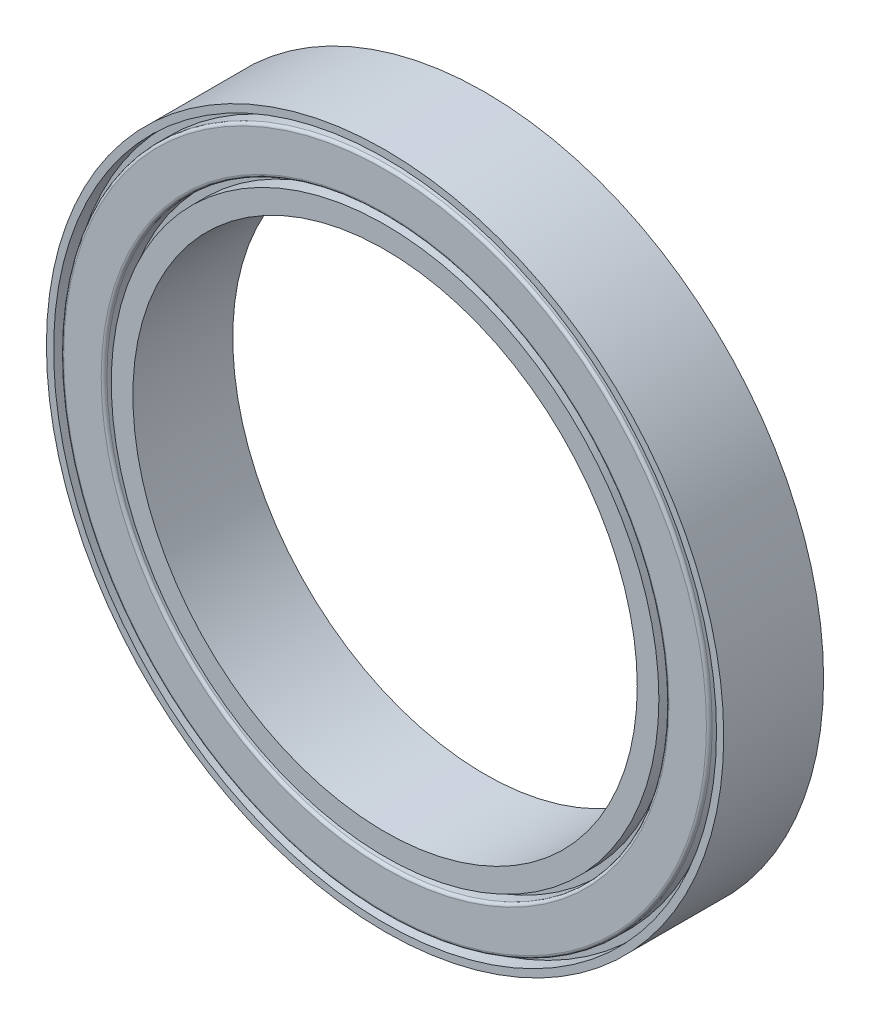
ISO-10303-21;
HEADER;
FILE_DESCRIPTION(('STEP AP214'),'2;1');
FILE_NAME('part.step','',(''),(''),'','','');
FILE_SCHEMA(('AUTOMOTIVE_DESIGN { 1 0 10303 214 1 1 1 1 }'));
ENDSEC;
DATA;
#1=APPLICATION_CONTEXT('core data for automotive mechanical design processes');
#2=APPLICATION_PROTOCOL_DEFINITION('international standard','automotive_design',2000,#1);
#3=PRODUCT_CONTEXT('',#1,'mechanical');
#4=PRODUCT('Part','Part','',(#3));
#5=PRODUCT_RELATED_PRODUCT_CATEGORY('part','',(#4));
#6=PRODUCT_DEFINITION_FORMATION('','',#4);
#7=PRODUCT_DEFINITION_CONTEXT('part definition',#1,'design');
#8=PRODUCT_DEFINITION('design','',#6,#7);
#9=PRODUCT_DEFINITION_SHAPE('','',#8);
#10=(LENGTH_UNIT() NAMED_UNIT(*) SI_UNIT(.MILLI.,.METRE.));
#11=(NAMED_UNIT(*) PLANE_ANGLE_UNIT() SI_UNIT($,.RADIAN.));
#12=(NAMED_UNIT(*) SI_UNIT($,.STERADIAN.) SOLID_ANGLE_UNIT());
#13=UNCERTAINTY_MEASURE_WITH_UNIT(LENGTH_MEASURE(1.E-05),#10,'distance_accuracy_value','');
#14=(GEOMETRIC_REPRESENTATION_CONTEXT(3) GLOBAL_UNCERTAINTY_ASSIGNED_CONTEXT((#13)) GLOBAL_UNIT_ASSIGNED_CONTEXT((#10,
#11,#12)) REPRESENTATION_CONTEXT('',''));
#15=CARTESIAN_POINT('',(0.,0.,0.));
#16=DIRECTION('',(0.,0.,1.));
#17=DIRECTION('',(1.,0.,0.));
#18=AXIS2_PLACEMENT_3D('',#15,#16,#17);
#19=CARTESIAN_POINT('',(0.,0.,0.));
#20=DIRECTION('',(0.,0.,1.));
#21=DIRECTION('',(1.,0.,0.));
#22=AXIS2_PLACEMENT_3D('',#19,#20,#21);
#23=PLANE('',#22);
#24=CARTESIAN_POINT('',(0.,0.,0.));
#25=DIRECTION('',(0.,0.,1.));
#26=DIRECTION('',(1.,0.,0.));
#27=AXIS2_PLACEMENT_3D('',#24,#25,#26);
#28=CIRCLE('',#27,17.5);
#29=CARTESIAN_POINT('',(17.5,0.,0.));
#30=VERTEX_POINT('',#29);
#31=EDGE_CURVE('E85',#30,#30,#28,.T.);
#32=ORIENTED_EDGE('',*,*,#31,.T.);
#33=EDGE_LOOP('',(#32));
#34=FACE_BOUND('',#33,.T.);
#35=CARTESIAN_POINT('',(0.,0.,0.));
#36=DIRECTION('',(0.,0.,1.));
#37=DIRECTION('',(1.,0.,0.));
#38=AXIS2_PLACEMENT_3D('',#35,#36,#37);
#39=CIRCLE('',#38,19.);
#40=CARTESIAN_POINT('',(19.,0.,0.));
#41=VERTEX_POINT('',#40);
#42=EDGE_CURVE('E121',#41,#41,#39,.T.);
#43=ORIENTED_EDGE('',*,*,#42,.F.);
#44=EDGE_LOOP('',(#43));
#45=FACE_BOUND('',#44,.T.);
#46=ADVANCED_FACE('F46',(#34,#45),#23,.F.);
#47=CARTESIAN_POINT('',(0.,0.,0.));
#48=DIRECTION('',(0.,0.,1.));
#49=DIRECTION('',(1.,0.,0.));
#50=AXIS2_PLACEMENT_3D('',#47,#48,#49);
#51=CIRCLE('',#50,19.7);
#52=CARTESIAN_POINT('',(19.7,0.,0.));
#53=VERTEX_POINT('',#52);
#54=EDGE_CURVE('E72',#53,#53,#51,.T.);
#55=ORIENTED_EDGE('',*,*,#54,.T.);
#56=EDGE_LOOP('',(#55));
#57=FACE_BOUND('',#56,.T.);
#58=CARTESIAN_POINT('',(0.,0.,0.));
#59=DIRECTION('',(0.,0.,1.));
#60=DIRECTION('',(1.,0.,0.));
#61=AXIS2_PLACEMENT_3D('',#58,#59,#60);
#62=CIRCLE('',#61,22.3);
#63=CARTESIAN_POINT('',(22.3,0.,0.));
#64=VERTEX_POINT('',#63);
#65=EDGE_CURVE('E75',#64,#64,#62,.F.);
#66=ORIENTED_EDGE('',*,*,#65,.T.);
#67=EDGE_LOOP('',(#66));
#68=FACE_BOUND('',#67,.T.);
#69=ADVANCED_FACE('F138',(#57,#68),#23,.F.);
#70=CARTESIAN_POINT('',(0.,0.,6.93));
#71=DIRECTION('',(0.,0.,1.));
#72=DIRECTION('',(1.,0.,0.));
#73=AXIS2_PLACEMENT_3D('',#70,#71,#72);
#74=PLANE('',#73);
#75=CARTESIAN_POINT('',(0.,0.,6.93));
#76=DIRECTION('',(0.,0.,1.));
#77=DIRECTION('',(1.,0.,0.));
#78=AXIS2_PLACEMENT_3D('',#75,#76,#77);
#79=CIRCLE('',#78,17.5);
#80=CARTESIAN_POINT('',(17.5,0.,6.93));
#81=VERTEX_POINT('',#80);
#82=EDGE_CURVE('E82',#81,#81,#79,.T.);
#83=ORIENTED_EDGE('',*,*,#82,.F.);
#84=EDGE_LOOP('',(#83));
#85=FACE_BOUND('',#84,.T.);
#86=CARTESIAN_POINT('',(0.,0.,6.93));
#87=DIRECTION('',(0.,0.,1.));
#88=DIRECTION('',(1.,0.,0.));
#89=AXIS2_PLACEMENT_3D('',#86,#87,#88);
#90=CIRCLE('',#89,19.);
#91=CARTESIAN_POINT('',(19.,0.,6.93));
#92=VERTEX_POINT('',#91);
#93=EDGE_CURVE('E103',#92,#92,#90,.T.);
#94=ORIENTED_EDGE('',*,*,#93,.T.);
#95=EDGE_LOOP('',(#94));
#96=FACE_BOUND('',#95,.T.);
#97=ADVANCED_FACE('F145',(#85,#96),#74,.T.);
#98=CARTESIAN_POINT('',(0.,0.,6.93));
#99=DIRECTION('',(0.,0.,1.));
#100=DIRECTION('',(1.,0.,0.));
#101=AXIS2_PLACEMENT_3D('',#98,#99,#100);
#102=CIRCLE('',#101,19.7);
#103=CARTESIAN_POINT('',(19.7,0.,6.93));
#104=VERTEX_POINT('',#103);
#105=EDGE_CURVE('E53',#104,#104,#102,.F.);
#106=ORIENTED_EDGE('',*,*,#105,.T.);
#107=EDGE_LOOP('',(#106));
#108=FACE_BOUND('',#107,.T.);
#109=CARTESIAN_POINT('',(0.,0.,6.93));
#110=DIRECTION('',(0.,0.,1.));
#111=DIRECTION('',(1.,0.,0.));
#112=AXIS2_PLACEMENT_3D('',#109,#110,#111);
#113=CIRCLE('',#112,22.3);
#114=CARTESIAN_POINT('',(22.3,0.,6.93));
#115=VERTEX_POINT('',#114);
#116=EDGE_CURVE('E57',#115,#115,#113,.T.);
#117=ORIENTED_EDGE('',*,*,#116,.T.);
#118=EDGE_LOOP('',(#117));
#119=FACE_BOUND('',#118,.T.);
#120=ADVANCED_FACE('F159',(#108,#119),#74,.T.);
#121=CARTESIAN_POINT('',(0.,0.,6.93));
#122=DIRECTION('',(0.,0.,1.));
#123=DIRECTION('',(1.,0.,0.));
#124=AXIS2_PLACEMENT_3D('',#121,#122,#123);
#125=CIRCLE('',#124,23.);
#126=CARTESIAN_POINT('',(23.,0.,6.93));
#127=VERTEX_POINT('',#126);
#128=EDGE_CURVE('E91',#127,#127,#125,.T.);
#129=ORIENTED_EDGE('',*,*,#128,.F.);
#130=EDGE_LOOP('',(#129));
#131=FACE_BOUND('',#130,.T.);
#132=CARTESIAN_POINT('',(0.,0.,6.93));
#133=DIRECTION('',(0.,0.,1.));
#134=DIRECTION('',(1.,0.,0.));
#135=AXIS2_PLACEMENT_3D('',#132,#133,#134);
#136=CIRCLE('',#135,23.5);
#137=CARTESIAN_POINT('',(23.5,0.,6.93));
#138=VERTEX_POINT('',#137);
#139=EDGE_CURVE('E78',#138,#138,#136,.T.);
#140=ORIENTED_EDGE('',*,*,#139,.T.);
#141=EDGE_LOOP('',(#140));
#142=FACE_BOUND('',#141,.T.);
#143=ADVANCED_FACE('F151',(#131,#142),#74,.T.);
#144=CARTESIAN_POINT('',(0.,0.,0.));
#145=DIRECTION('',(0.,0.,1.));
#146=DIRECTION('',(1.,0.,0.));
#147=AXIS2_PLACEMENT_3D('',#144,#145,#146);
#148=CIRCLE('',#147,23.);
#149=CARTESIAN_POINT('',(23.,0.,0.));
#150=VERTEX_POINT('',#149);
#151=EDGE_CURVE('E109',#150,#150,#148,.T.);
#152=ORIENTED_EDGE('',*,*,#151,.T.);
#153=EDGE_LOOP('',(#152));
#154=FACE_BOUND('',#153,.T.);
#155=CARTESIAN_POINT('',(0.,0.,0.));
#156=DIRECTION('',(0.,0.,1.));
#157=DIRECTION('',(1.,0.,0.));
#158=AXIS2_PLACEMENT_3D('',#155,#156,#157);
#159=CIRCLE('',#158,23.5);
#160=CARTESIAN_POINT('',(23.5,0.,0.));
#161=VERTEX_POINT('',#160);
#162=EDGE_CURVE('E79',#161,#161,#159,.T.);
#163=ORIENTED_EDGE('',*,*,#162,.F.);
#164=EDGE_LOOP('',(#163));
#165=FACE_BOUND('',#164,.T.);
#166=ADVANCED_FACE('F141',(#154,#165),#23,.F.);
#167=CARTESIAN_POINT('',(0.,0.,6.93));
#168=DIRECTION('',(0.,0.,-1.));
#169=DIRECTION('',(-1.,0.,0.));
#170=AXIS2_PLACEMENT_3D('',#167,#168,#169);
#171=CYLINDRICAL_SURFACE('',#170,23.5);
#172=ORIENTED_EDGE('',*,*,#139,.F.);
#173=EDGE_LOOP('',(#172));
#174=FACE_BOUND('',#173,.T.);
#175=ORIENTED_EDGE('',*,*,#162,.T.);
#176=EDGE_LOOP('',(#175));
#177=FACE_BOUND('',#176,.T.);
#178=ADVANCED_FACE('F150',(#174,#177),#171,.T.);
#179=CARTESIAN_POINT('',(0.,0.,6.93));
#180=DIRECTION('',(0.,0.,-1.));
#181=DIRECTION('',(-1.,0.,0.));
#182=AXIS2_PLACEMENT_3D('',#179,#180,#181);
#183=CYLINDRICAL_SURFACE('',#182,17.5);
#184=ORIENTED_EDGE('',*,*,#82,.T.);
#185=EDGE_LOOP('',(#184));
#186=FACE_BOUND('',#185,.T.);
#187=ORIENTED_EDGE('',*,*,#31,.F.);
#188=EDGE_LOOP('',(#187));
#189=FACE_BOUND('',#188,.T.);
#190=ADVANCED_FACE('F157',(#186,#189),#183,.F.);
#191=CARTESIAN_POINT('',(0.,0.,5.93));
#192=DIRECTION('',(0.,0.,1.));
#193=DIRECTION('',(1.,0.,0.));
#194=AXIS2_PLACEMENT_3D('',#191,#192,#193);
#195=CYLINDRICAL_SURFACE('',#194,23.);
#196=CARTESIAN_POINT('',(0.,0.,5.93));
#197=DIRECTION('',(0.,0.,1.));
#198=DIRECTION('',(1.,0.,0.));
#199=AXIS2_PLACEMENT_3D('',#196,#197,#198);
#200=CIRCLE('',#199,23.);
#201=CARTESIAN_POINT('',(23.,0.,5.93));
#202=VERTEX_POINT('',#201);
#203=EDGE_CURVE('E88',#202,#202,#200,.T.);
#204=ORIENTED_EDGE('',*,*,#203,.F.);
#205=EDGE_LOOP('',(#204));
#206=FACE_BOUND('',#205,.T.);
#207=ORIENTED_EDGE('',*,*,#128,.T.);
#208=EDGE_LOOP('',(#207));
#209=FACE_BOUND('',#208,.T.);
#210=ADVANCED_FACE('F199',(#206,#209),#195,.F.);
#211=CARTESIAN_POINT('',(0.,0.,5.93));
#212=DIRECTION('',(0.,0.,1.));
#213=DIRECTION('',(1.,0.,0.));
#214=AXIS2_PLACEMENT_3D('',#211,#212,#213);
#215=PLANE('',#214);
#216=CARTESIAN_POINT('',(0.,0.,5.93));
#217=DIRECTION('',(0.,0.,1.));
#218=DIRECTION('',(1.,0.,0.));
#219=AXIS2_PLACEMENT_3D('',#216,#217,#218);
#220=CIRCLE('',#219,22.5);
#221=CARTESIAN_POINT('',(22.5,0.,5.93));
#222=VERTEX_POINT('',#221);
#223=EDGE_CURVE('E94',#222,#222,#220,.T.);
#224=ORIENTED_EDGE('',*,*,#223,.F.);
#225=EDGE_LOOP('',(#224));
#226=FACE_BOUND('',#225,.T.);
#227=ORIENTED_EDGE('',*,*,#203,.T.);
#228=EDGE_LOOP('',(#227));
#229=FACE_BOUND('',#228,.T.);
#230=ADVANCED_FACE('F196',(#226,#229),#215,.T.);
#231=CARTESIAN_POINT('',(0.,0.,5.93));
#232=DIRECTION('',(0.,0.,1.));
#233=DIRECTION('',(1.,0.,0.));
#234=AXIS2_PLACEMENT_3D('',#231,#232,#233);
#235=CYLINDRICAL_SURFACE('',#234,22.5);
#236=CARTESIAN_POINT('',(0.,0.,6.73));
#237=DIRECTION('',(0.,0.,1.));
#238=DIRECTION('',(1.,0.,0.));
#239=AXIS2_PLACEMENT_3D('',#236,#237,#238);
#240=CIRCLE('',#239,22.5);
#241=CARTESIAN_POINT('',(22.5,0.,6.73));
#242=VERTEX_POINT('',#241);
#243=EDGE_CURVE('E11',#242,#242,#240,.F.);
#244=ORIENTED_EDGE('',*,*,#243,.T.);
#245=EDGE_LOOP('',(#244));
#246=FACE_BOUND('',#245,.T.);
#247=ORIENTED_EDGE('',*,*,#223,.T.);
#248=EDGE_LOOP('',(#247));
#249=FACE_BOUND('',#248,.T.);
#250=ADVANCED_FACE('F192',(#246,#249),#235,.T.);
#251=CARTESIAN_POINT('',(0.,0.,5.93));
#252=DIRECTION('',(0.,0.,1.));
#253=DIRECTION('',(1.,0.,0.));
#254=AXIS2_PLACEMENT_3D('',#251,#252,#253);
#255=CYLINDRICAL_SURFACE('',#254,19.5);
#256=CARTESIAN_POINT('',(0.,0.,6.73));
#257=DIRECTION('',(0.,0.,1.));
#258=DIRECTION('',(1.,0.,0.));
#259=AXIS2_PLACEMENT_3D('',#256,#257,#258);
#260=CIRCLE('',#259,19.5);
#261=CARTESIAN_POINT('',(19.5,0.,6.73));
#262=VERTEX_POINT('',#261);
#263=EDGE_CURVE('E61',#262,#262,#260,.T.);
#264=ORIENTED_EDGE('',*,*,#263,.T.);
#265=EDGE_LOOP('',(#264));
#266=FACE_BOUND('',#265,.T.);
#267=CARTESIAN_POINT('',(0.,0.,5.93));
#268=DIRECTION('',(0.,0.,1.));
#269=DIRECTION('',(1.,0.,0.));
#270=AXIS2_PLACEMENT_3D('',#267,#268,#269);
#271=CIRCLE('',#270,19.5);
#272=CARTESIAN_POINT('',(19.5,0.,5.93));
#273=VERTEX_POINT('',#272);
#274=EDGE_CURVE('E99',#273,#273,#271,.T.);
#275=ORIENTED_EDGE('',*,*,#274,.F.);
#276=EDGE_LOOP('',(#275));
#277=FACE_BOUND('',#276,.T.);
#278=ADVANCED_FACE('F188',(#266,#277),#255,.F.);
#279=CARTESIAN_POINT('',(0.,0.,5.93));
#280=DIRECTION('',(0.,0.,1.));
#281=DIRECTION('',(1.,0.,0.));
#282=AXIS2_PLACEMENT_3D('',#279,#280,#281);
#283=PLANE('',#282);
#284=CARTESIAN_POINT('',(0.,0.,5.93));
#285=DIRECTION('',(0.,0.,1.));
#286=DIRECTION('',(1.,0.,0.));
#287=AXIS2_PLACEMENT_3D('',#284,#285,#286);
#288=CIRCLE('',#287,19.);
#289=CARTESIAN_POINT('',(19.,0.,5.93));
#290=VERTEX_POINT('',#289);
#291=EDGE_CURVE('E102',#290,#290,#288,.T.);
#292=ORIENTED_EDGE('',*,*,#291,.F.);
#293=EDGE_LOOP('',(#292));
#294=FACE_BOUND('',#293,.T.);
#295=ORIENTED_EDGE('',*,*,#274,.T.);
#296=EDGE_LOOP('',(#295));
#297=FACE_BOUND('',#296,.T.);
#298=ADVANCED_FACE('F184',(#294,#297),#283,.T.);
#299=CARTESIAN_POINT('',(0.,0.,5.93));
#300=DIRECTION('',(0.,0.,1.));
#301=DIRECTION('',(1.,0.,0.));
#302=AXIS2_PLACEMENT_3D('',#299,#300,#301);
#303=CYLINDRICAL_SURFACE('',#302,19.);
#304=ORIENTED_EDGE('',*,*,#291,.T.);
#305=EDGE_LOOP('',(#304));
#306=FACE_BOUND('',#305,.T.);
#307=ORIENTED_EDGE('',*,*,#93,.F.);
#308=EDGE_LOOP('',(#307));
#309=FACE_BOUND('',#308,.T.);
#310=ADVANCED_FACE('F178',(#306,#309),#303,.T.);
#311=CARTESIAN_POINT('',(0.,0.,1.));
#312=DIRECTION('',(0.,0.,-1.));
#313=DIRECTION('',(1.,0.,0.));
#314=AXIS2_PLACEMENT_3D('',#311,#312,#313);
#315=PLANE('',#314);
#316=CARTESIAN_POINT('',(0.,0.,1.));
#317=DIRECTION('',(0.,0.,1.));
#318=DIRECTION('',(1.,0.,0.));
#319=AXIS2_PLACEMENT_3D('',#316,#317,#318);
#320=CIRCLE('',#319,23.);
#321=CARTESIAN_POINT('',(23.,0.,1.));
#322=VERTEX_POINT('',#321);
#323=EDGE_CURVE('E106',#322,#322,#320,.T.);
#324=ORIENTED_EDGE('',*,*,#323,.F.);
#325=EDGE_LOOP('',(#324));
#326=FACE_BOUND('',#325,.T.);
#327=CARTESIAN_POINT('',(0.,0.,1.));
#328=DIRECTION('',(0.,0.,1.));
#329=DIRECTION('',(1.,0.,0.));
#330=AXIS2_PLACEMENT_3D('',#327,#328,#329);
#331=CIRCLE('',#330,22.5);
#332=CARTESIAN_POINT('',(22.5,0.,1.));
#333=VERTEX_POINT('',#332);
#334=EDGE_CURVE('E112',#333,#333,#331,.T.);
#335=ORIENTED_EDGE('',*,*,#334,.T.);
#336=EDGE_LOOP('',(#335));
#337=FACE_BOUND('',#336,.T.);
#338=ADVANCED_FACE('F169',(#326,#337),#315,.T.);
#339=CARTESIAN_POINT('',(0.,0.,1.));
#340=DIRECTION('',(0.,0.,-1.));
#341=DIRECTION('',(-1.,0.,0.));
#342=AXIS2_PLACEMENT_3D('',#339,#340,#341);
#343=CYLINDRICAL_SURFACE('',#342,23.);
#344=ORIENTED_EDGE('',*,*,#323,.T.);
#345=EDGE_LOOP('',(#344));
#346=FACE_BOUND('',#345,.T.);
#347=ORIENTED_EDGE('',*,*,#151,.F.);
#348=EDGE_LOOP('',(#347));
#349=FACE_BOUND('',#348,.T.);
#350=ADVANCED_FACE('F166',(#346,#349),#343,.F.);
#351=CARTESIAN_POINT('',(0.,0.,1.));
#352=DIRECTION('',(0.,0.,-1.));
#353=DIRECTION('',(-1.,0.,0.));
#354=AXIS2_PLACEMENT_3D('',#351,#352,#353);
#355=CYLINDRICAL_SURFACE('',#354,22.5);
#356=CARTESIAN_POINT('',(0.,0.,0.2));
#357=DIRECTION('',(0.,0.,1.));
#358=DIRECTION('',(1.,0.,0.));
#359=AXIS2_PLACEMENT_3D('',#356,#357,#358);
#360=CIRCLE('',#359,22.5);
#361=CARTESIAN_POINT('',(22.5,0.,0.2));
#362=VERTEX_POINT('',#361);
#363=EDGE_CURVE('E66',#362,#362,#360,.T.);
#364=ORIENTED_EDGE('',*,*,#363,.T.);
#365=EDGE_LOOP('',(#364));
#366=FACE_BOUND('',#365,.T.);
#367=ORIENTED_EDGE('',*,*,#334,.F.);
#368=EDGE_LOOP('',(#367));
#369=FACE_BOUND('',#368,.T.);
#370=ADVANCED_FACE('F168',(#366,#369),#355,.T.);
#371=CARTESIAN_POINT('',(0.,0.,1.));
#372=DIRECTION('',(0.,0.,-1.));
#373=DIRECTION('',(1.,0.,0.));
#374=AXIS2_PLACEMENT_3D('',#371,#372,#373);
#375=PLANE('',#374);
#376=CARTESIAN_POINT('',(0.,0.,1.));
#377=DIRECTION('',(0.,0.,1.));
#378=DIRECTION('',(1.,0.,0.));
#379=AXIS2_PLACEMENT_3D('',#376,#377,#378);
#380=CIRCLE('',#379,19.5);
#381=CARTESIAN_POINT('',(19.5,0.,1.));
#382=VERTEX_POINT('',#381);
#383=EDGE_CURVE('E117',#382,#382,#380,.T.);
#384=ORIENTED_EDGE('',*,*,#383,.F.);
#385=EDGE_LOOP('',(#384));
#386=FACE_BOUND('',#385,.T.);
#387=CARTESIAN_POINT('',(0.,0.,1.));
#388=DIRECTION('',(0.,0.,1.));
#389=DIRECTION('',(1.,0.,0.));
#390=AXIS2_PLACEMENT_3D('',#387,#388,#389);
#391=CIRCLE('',#390,19.);
#392=CARTESIAN_POINT('',(19.,0.,1.));
#393=VERTEX_POINT('',#392);
#394=EDGE_CURVE('E120',#393,#393,#391,.T.);
#395=ORIENTED_EDGE('',*,*,#394,.T.);
#396=EDGE_LOOP('',(#395));
#397=FACE_BOUND('',#396,.T.);
#398=ADVANCED_FACE('F127',(#386,#397),#375,.T.);
#399=CARTESIAN_POINT('',(0.,0.,1.));
#400=DIRECTION('',(0.,0.,-1.));
#401=DIRECTION('',(-1.,0.,0.));
#402=AXIS2_PLACEMENT_3D('',#399,#400,#401);
#403=CYLINDRICAL_SURFACE('',#402,19.5);
#404=CARTESIAN_POINT('',(0.,0.,0.2));
#405=DIRECTION('',(0.,0.,1.));
#406=DIRECTION('',(1.,0.,0.));
#407=AXIS2_PLACEMENT_3D('',#404,#405,#406);
#408=CIRCLE('',#407,19.5);
#409=CARTESIAN_POINT('',(19.5,0.,0.2));
#410=VERTEX_POINT('',#409);
#411=EDGE_CURVE('E69',#410,#410,#408,.F.);
#412=ORIENTED_EDGE('',*,*,#411,.T.);
#413=EDGE_LOOP('',(#412));
#414=FACE_BOUND('',#413,.T.);
#415=ORIENTED_EDGE('',*,*,#383,.T.);
#416=EDGE_LOOP('',(#415));
#417=FACE_BOUND('',#416,.T.);
#418=ADVANCED_FACE('F133',(#414,#417),#403,.F.);
#419=CARTESIAN_POINT('',(0.,0.,1.));
#420=DIRECTION('',(0.,0.,-1.));
#421=DIRECTION('',(-1.,0.,0.));
#422=AXIS2_PLACEMENT_3D('',#419,#420,#421);
#423=CYLINDRICAL_SURFACE('',#422,19.);
#424=ORIENTED_EDGE('',*,*,#394,.F.);
#425=EDGE_LOOP('',(#424));
#426=FACE_BOUND('',#425,.T.);
#427=ORIENTED_EDGE('',*,*,#42,.T.);
#428=EDGE_LOOP('',(#427));
#429=FACE_BOUND('',#428,.T.);
#430=ADVANCED_FACE('F129',(#426,#429),#423,.T.);
#431=CARTESIAN_POINT('',(0.,0.,0.2));
#432=DIRECTION('',(0.,0.,1.));
#433=DIRECTION('',(1.,0.,0.));
#434=AXIS2_PLACEMENT_3D('',#431,#432,#433);
#435=TOROIDAL_SURFACE('',#434,19.7,0.2);
#436=ORIENTED_EDGE('',*,*,#411,.F.);
#437=EDGE_LOOP('',(#436));
#438=FACE_BOUND('',#437,.T.);
#439=ORIENTED_EDGE('',*,*,#54,.F.);
#440=EDGE_LOOP('',(#439));
#441=FACE_BOUND('',#440,.T.);
#442=ADVANCED_FACE('F132',(#438,#441),#435,.T.);
#443=CARTESIAN_POINT('',(0.,0.,0.2));
#444=DIRECTION('',(0.,0.,1.));
#445=DIRECTION('',(1.,0.,0.));
#446=AXIS2_PLACEMENT_3D('',#443,#444,#445);
#447=TOROIDAL_SURFACE('',#446,22.3,0.2);
#448=ORIENTED_EDGE('',*,*,#65,.F.);
#449=EDGE_LOOP('',(#448));
#450=FACE_BOUND('',#449,.T.);
#451=ORIENTED_EDGE('',*,*,#363,.F.);
#452=EDGE_LOOP('',(#451));
#453=FACE_BOUND('',#452,.T.);
#454=ADVANCED_FACE('F230',(#450,#453),#447,.T.);
#455=CARTESIAN_POINT('',(0.,0.,6.73));
#456=DIRECTION('',(0.,0.,1.));
#457=DIRECTION('',(1.,0.,0.));
#458=AXIS2_PLACEMENT_3D('',#455,#456,#457);
#459=TOROIDAL_SURFACE('',#458,19.7,0.2);
#460=ORIENTED_EDGE('',*,*,#105,.F.);
#461=EDGE_LOOP('',(#460));
#462=FACE_BOUND('',#461,.T.);
#463=ORIENTED_EDGE('',*,*,#263,.F.);
#464=EDGE_LOOP('',(#463));
#465=FACE_BOUND('',#464,.T.);
#466=ADVANCED_FACE('F225',(#462,#465),#459,.T.);
#467=CARTESIAN_POINT('',(0.,0.,6.73));
#468=DIRECTION('',(0.,0.,1.));
#469=DIRECTION('',(1.,0.,0.));
#470=AXIS2_PLACEMENT_3D('',#467,#468,#469);
#471=TOROIDAL_SURFACE('',#470,22.3,0.2);
#472=ORIENTED_EDGE('',*,*,#243,.F.);
#473=EDGE_LOOP('',(#472));
#474=FACE_BOUND('',#473,.T.);
#475=ORIENTED_EDGE('',*,*,#116,.F.);
#476=EDGE_LOOP('',(#475));
#477=FACE_BOUND('',#476,.T.);
#478=ADVANCED_FACE('F48',(#474,#477),#471,.T.);
#479=CLOSED_SHELL('',(#46,#69,#97,#120,#143,#166,#178,#190,#210,#230,#250,#278,#298,#310,#338,
#350,#370,#398,#418,#430,#442,#454,#466,#478));
#480=MANIFOLD_SOLID_BREP('B2',#479);
#481=ADVANCED_BREP_SHAPE_REPRESENTATION('',(#18,#480),#14);
#482=SHAPE_DEFINITION_REPRESENTATION(#9,#481);
ENDSEC;
END-ISO-10303-21;
